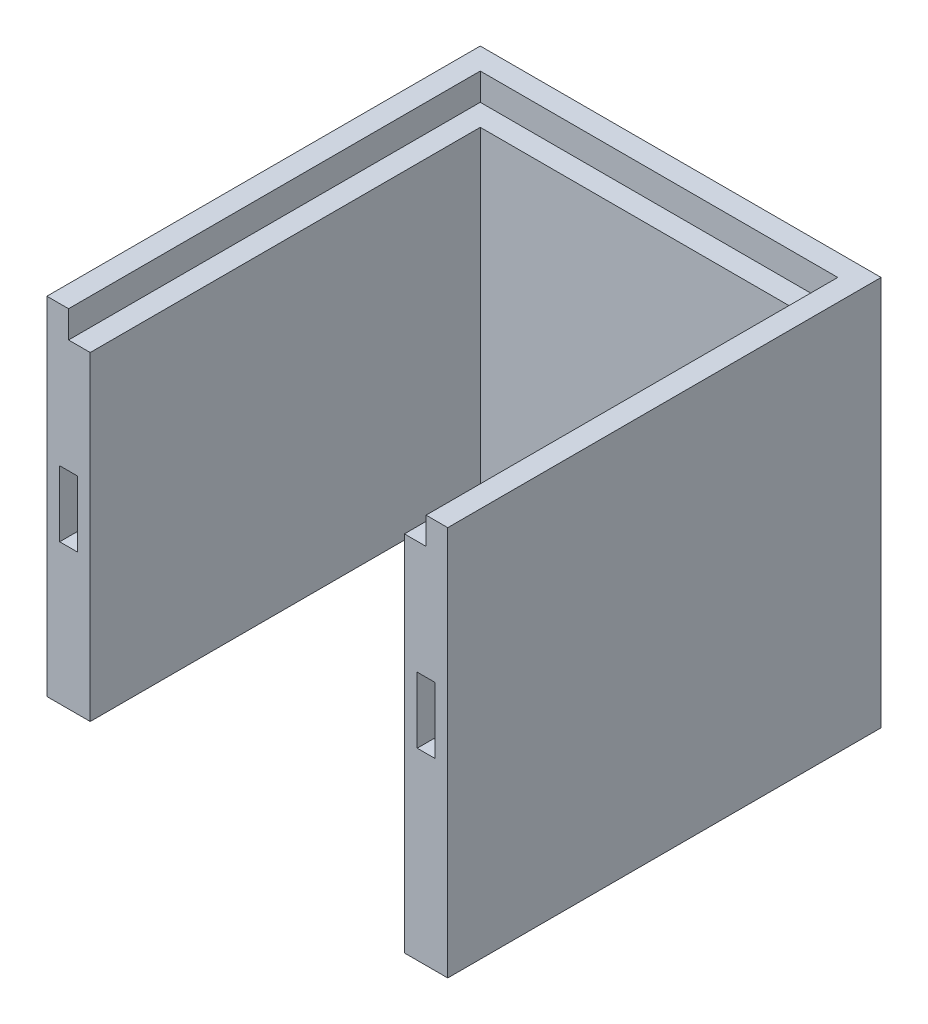
ISO-10303-21;
HEADER;
FILE_DESCRIPTION(('STEP AP214'),'2;1');
FILE_NAME('part.step','',(''),(''),'','','');
FILE_SCHEMA(('AUTOMOTIVE_DESIGN { 1 0 10303 214 1 1 1 1 }'));
ENDSEC;
DATA;
#1=APPLICATION_CONTEXT('core data for automotive mechanical design processes');
#2=APPLICATION_PROTOCOL_DEFINITION('international standard','automotive_design',2000,#1);
#3=PRODUCT_CONTEXT('',#1,'mechanical');
#4=PRODUCT('Part','Part','',(#3));
#5=PRODUCT_RELATED_PRODUCT_CATEGORY('part','',(#4));
#6=PRODUCT_DEFINITION_FORMATION('','',#4);
#7=PRODUCT_DEFINITION_CONTEXT('part definition',#1,'design');
#8=PRODUCT_DEFINITION('design','',#6,#7);
#9=PRODUCT_DEFINITION_SHAPE('','',#8);
#10=(LENGTH_UNIT() NAMED_UNIT(*) SI_UNIT(.MILLI.,.METRE.));
#11=(NAMED_UNIT(*) PLANE_ANGLE_UNIT() SI_UNIT($,.RADIAN.));
#12=(NAMED_UNIT(*) SI_UNIT($,.STERADIAN.) SOLID_ANGLE_UNIT());
#13=UNCERTAINTY_MEASURE_WITH_UNIT(LENGTH_MEASURE(1.E-05),#10,'distance_accuracy_value','');
#14=(GEOMETRIC_REPRESENTATION_CONTEXT(3) GLOBAL_UNCERTAINTY_ASSIGNED_CONTEXT((#13)) GLOBAL_UNIT_ASSIGNED_CONTEXT((#10,
#11,#12)) REPRESENTATION_CONTEXT('',''));
#15=CARTESIAN_POINT('',(0.,0.,0.));
#16=DIRECTION('',(0.,0.,1.));
#17=DIRECTION('',(1.,0.,0.));
#18=AXIS2_PLACEMENT_3D('',#15,#16,#17);
#19=CARTESIAN_POINT('',(0.,0.,200.));
#20=DIRECTION('',(0.,0.,-1.));
#21=DIRECTION('',(-1.,0.,0.));
#22=AXIS2_PLACEMENT_3D('',#19,#20,#21);
#23=PLANE('',#22);
#24=DIRECTION('',(-1.,0.,0.));
#25=VECTOR('',#24,1.);
#26=CARTESIAN_POINT('',(185.,160.,200.));
#27=LINE('',#26,#25);
#28=CARTESIAN_POINT('',(185.,160.,200.));
#29=VERTEX_POINT('',#28);
#30=CARTESIAN_POINT('',(175.,160.,200.));
#31=VERTEX_POINT('',#30);
#32=EDGE_CURVE('E439',#29,#31,#27,.T.);
#33=ORIENTED_EDGE('',*,*,#32,.T.);
#34=DIRECTION('',(0.,1.,0.));
#35=VECTOR('',#34,1.);
#36=CARTESIAN_POINT('',(175.,147.5,200.));
#37=LINE('',#36,#35);
#38=CARTESIAN_POINT('',(175.,147.5,200.));
#39=VERTEX_POINT('',#38);
#40=EDGE_CURVE('E271',#39,#31,#37,.T.);
#41=ORIENTED_EDGE('',*,*,#40,.F.);
#42=DIRECTION('',(1.,0.,0.));
#43=VECTOR('',#42,1.);
#44=CARTESIAN_POINT('',(10.,147.5,200.));
#45=LINE('',#44,#43);
#46=CARTESIAN_POINT('',(165.,147.5,200.));
#47=VERTEX_POINT('',#46);
#48=EDGE_CURVE('E280',#47,#39,#45,.T.);
#49=ORIENTED_EDGE('',*,*,#48,.F.);
#50=DIRECTION('',(0.,-1.,0.));
#51=VECTOR('',#50,1.);
#52=CARTESIAN_POINT('',(165.,160.,200.));
#53=LINE('',#52,#51);
#54=CARTESIAN_POINT('',(165.,-20.,200.));
#55=VERTEX_POINT('',#54);
#56=EDGE_CURVE('E443',#47,#55,#53,.T.);
#57=ORIENTED_EDGE('',*,*,#56,.T.);
#58=DIRECTION('',(-1.,0.,0.));
#59=VECTOR('',#58,1.);
#60=CARTESIAN_POINT('',(185.,-20.,200.));
#61=LINE('',#60,#59);
#62=CARTESIAN_POINT('',(185.,-20.,200.));
#63=VERTEX_POINT('',#62);
#64=EDGE_CURVE('E395',#63,#55,#61,.T.);
#65=ORIENTED_EDGE('',*,*,#64,.F.);
#66=DIRECTION('',(0.,1.,0.));
#67=VECTOR('',#66,1.);
#68=CARTESIAN_POINT('',(185.,160.,200.));
#69=LINE('',#68,#67);
#70=EDGE_CURVE('E435',#63,#29,#69,.T.);
#71=ORIENTED_EDGE('',*,*,#70,.T.);
#72=EDGE_LOOP('',(#33,#41,#49,#57,#65,#71));
#73=FACE_BOUND('',#72,.T.);
#74=DIRECTION('',(0.,1.,0.));
#75=VECTOR('',#74,1.);
#76=CARTESIAN_POINT('',(170.9,64.8,200.));
#77=LINE('',#76,#75);
#78=CARTESIAN_POINT('',(170.9,64.8,200.));
#79=VERTEX_POINT('',#78);
#80=CARTESIAN_POINT('',(170.9,95.2,200.));
#81=VERTEX_POINT('',#80);
#82=EDGE_CURVE('E319',#79,#81,#77,.T.);
#83=ORIENTED_EDGE('',*,*,#82,.T.);
#84=DIRECTION('',(1.,0.,0.));
#85=VECTOR('',#84,1.);
#86=CARTESIAN_POINT('',(179.1,95.2,200.));
#87=LINE('',#86,#85);
#88=CARTESIAN_POINT('',(179.1,95.2,200.));
#89=VERTEX_POINT('',#88);
#90=EDGE_CURVE('E325',#81,#89,#87,.T.);
#91=ORIENTED_EDGE('',*,*,#90,.T.);
#92=DIRECTION('',(0.,-1.,0.));
#93=VECTOR('',#92,1.);
#94=CARTESIAN_POINT('',(179.1,64.8,200.));
#95=LINE('',#94,#93);
#96=CARTESIAN_POINT('',(179.1,64.8,200.));
#97=VERTEX_POINT('',#96);
#98=EDGE_CURVE('E337',#89,#97,#95,.T.);
#99=ORIENTED_EDGE('',*,*,#98,.T.);
#100=DIRECTION('',(-1.,0.,0.));
#101=VECTOR('',#100,1.);
#102=CARTESIAN_POINT('',(179.1,64.8,200.));
#103=LINE('',#102,#101);
#104=EDGE_CURVE('E333',#97,#79,#103,.T.);
#105=ORIENTED_EDGE('',*,*,#104,.T.);
#106=EDGE_LOOP('',(#83,#91,#99,#105));
#107=FACE_BOUND('',#106,.T.);
#108=ADVANCED_FACE('F38',(#73,#107),#23,.F.);
#109=CARTESIAN_POINT('',(0.,0.,20.));
#110=DIRECTION('',(0.,1.,0.));
#111=DIRECTION('',(0.,0.,1.));
#112=AXIS2_PLACEMENT_3D('',#109,#110,#111);
#113=PLANE('',#112);
#114=DIRECTION('',(1.,0.,0.));
#115=VECTOR('',#114,1.);
#116=CARTESIAN_POINT('',(0.,0.,0.));
#117=LINE('',#116,#115);
#118=CARTESIAN_POINT('',(122.5,0.,0.));
#119=VERTEX_POINT('',#118);
#120=CARTESIAN_POINT('',(160.,0.,0.));
#121=VERTEX_POINT('',#120);
#122=EDGE_CURVE('E478',#119,#121,#117,.T.);
#123=ORIENTED_EDGE('',*,*,#122,.T.);
#124=DIRECTION('',(0.,0.,-1.));
#125=VECTOR('',#124,1.);
#126=CARTESIAN_POINT('',(160.,0.,20.));
#127=LINE('',#126,#125);
#128=CARTESIAN_POINT('',(160.,0.,20.));
#129=VERTEX_POINT('',#128);
#130=EDGE_CURVE('E508',#121,#129,#127,.F.);
#131=ORIENTED_EDGE('',*,*,#130,.T.);
#132=DIRECTION('',(1.,0.,0.));
#133=VECTOR('',#132,1.);
#134=CARTESIAN_POINT('',(0.,0.,20.));
#135=LINE('',#134,#133);
#136=CARTESIAN_POINT('',(122.5,0.,20.));
#137=VERTEX_POINT('',#136);
#138=EDGE_CURVE('E474',#137,#129,#135,.T.);
#139=ORIENTED_EDGE('',*,*,#138,.F.);
#140=DIRECTION('',(0.,0.,-1.));
#141=VECTOR('',#140,1.);
#142=CARTESIAN_POINT('',(122.5,0.,20.));
#143=LINE('',#142,#141);
#144=EDGE_CURVE('E504',#137,#119,#143,.T.);
#145=ORIENTED_EDGE('',*,*,#144,.T.);
#146=EDGE_LOOP('',(#123,#131,#139,#145));
#147=FACE_BOUND('',#146,.T.);
#148=ADVANCED_FACE('F650',(#147),#113,.F.);
#149=CARTESIAN_POINT('',(0.,0.,0.));
#150=VERTEX_POINT('',#149);
#151=CARTESIAN_POINT('',(62.5,0.,0.));
#152=VERTEX_POINT('',#151);
#153=EDGE_CURVE('E479',#150,#152,#117,.T.);
#154=ORIENTED_EDGE('',*,*,#153,.T.);
#155=DIRECTION('',(0.,0.,-1.));
#156=VECTOR('',#155,1.);
#157=CARTESIAN_POINT('',(62.5,0.,20.));
#158=LINE('',#157,#156);
#159=CARTESIAN_POINT('',(62.5,0.,20.));
#160=VERTEX_POINT('',#159);
#161=EDGE_CURVE('E537',#152,#160,#158,.F.);
#162=ORIENTED_EDGE('',*,*,#161,.T.);
#163=CARTESIAN_POINT('',(20.,0.,20.));
#164=VERTEX_POINT('',#163);
#165=EDGE_CURVE('E469',#164,#160,#135,.T.);
#166=ORIENTED_EDGE('',*,*,#165,.F.);
#167=DIRECTION('',(0.,0.,-1.));
#168=VECTOR('',#167,1.);
#169=CARTESIAN_POINT('',(20.,0.,200.));
#170=LINE('',#169,#168);
#171=CARTESIAN_POINT('',(20.,0.,200.));
#172=VERTEX_POINT('',#171);
#173=EDGE_CURVE('E461',#172,#164,#170,.T.);
#174=ORIENTED_EDGE('',*,*,#173,.F.);
#175=DIRECTION('',(1.,0.,0.));
#176=VECTOR('',#175,1.);
#177=CARTESIAN_POINT('',(0.,0.,200.));
#178=LINE('',#177,#176);
#179=CARTESIAN_POINT('',(0.,0.,200.));
#180=VERTEX_POINT('',#179);
#181=EDGE_CURVE('E453',#180,#172,#178,.T.);
#182=ORIENTED_EDGE('',*,*,#181,.F.);
#183=DIRECTION('',(0.,0.,-1.));
#184=VECTOR('',#183,1.);
#185=CARTESIAN_POINT('',(0.,0.,20.));
#186=LINE('',#185,#184);
#187=EDGE_CURVE('E496',#180,#150,#186,.T.);
#188=ORIENTED_EDGE('',*,*,#187,.T.);
#189=EDGE_LOOP('',(#154,#162,#166,#174,#182,#188));
#190=FACE_BOUND('',#189,.T.);
#191=ADVANCED_FACE('F656',(#190),#113,.F.);
#192=CARTESIAN_POINT('',(0.,0.,20.));
#193=DIRECTION('',(0.,0.,-1.));
#194=DIRECTION('',(-1.,0.,0.));
#195=AXIS2_PLACEMENT_3D('',#192,#193,#194);
#196=PLANE('',#195);
#197=DIRECTION('',(0.,-1.,0.));
#198=VECTOR('',#197,1.);
#199=CARTESIAN_POINT('',(165.,160.,20.));
#200=LINE('',#199,#198);
#201=CARTESIAN_POINT('',(165.,147.5,20.));
#202=VERTEX_POINT('',#201);
#203=CARTESIAN_POINT('',(165.,-5.,20.));
#204=VERTEX_POINT('',#203);
#205=EDGE_CURVE('E434',#202,#204,#200,.T.);
#206=ORIENTED_EDGE('',*,*,#205,.F.);
#207=DIRECTION('',(-1.,0.,0.));
#208=VECTOR('',#207,1.);
#209=CARTESIAN_POINT('',(0.,147.5,20.));
#210=LINE('',#209,#208);
#211=CARTESIAN_POINT('',(20.,147.5,20.));
#212=VERTEX_POINT('',#211);
#213=EDGE_CURVE('E54',#202,#212,#210,.T.);
#214=ORIENTED_EDGE('',*,*,#213,.T.);
#215=DIRECTION('',(0.,1.,0.));
#216=VECTOR('',#215,1.);
#217=CARTESIAN_POINT('',(20.,160.,20.));
#218=LINE('',#217,#216);
#219=EDGE_CURVE('E446',#164,#212,#218,.T.);
#220=ORIENTED_EDGE('',*,*,#219,.F.);
#221=ORIENTED_EDGE('',*,*,#165,.T.);
#222=CARTESIAN_POINT('',(62.5,5.,20.));
#223=DIRECTION('',(0.,0.,-1.));
#224=DIRECTION('',(-1.,0.,0.));
#225=AXIS2_PLACEMENT_3D('',#222,#223,#224);
#226=CIRCLE('',#225,5.);
#227=CARTESIAN_POINT('',(67.5,5.,20.));
#228=VERTEX_POINT('',#227);
#229=EDGE_CURVE('E524',#160,#228,#226,.F.);
#230=ORIENTED_EDGE('',*,*,#229,.T.);
#231=DIRECTION('',(0.,1.,0.));
#232=VECTOR('',#231,1.);
#233=CARTESIAN_POINT('',(67.5,0.,20.));
#234=LINE('',#233,#232);
#235=CARTESIAN_POINT('',(67.5,45.,20.));
#236=VERTEX_POINT('',#235);
#237=EDGE_CURVE('E430',#228,#236,#234,.T.);
#238=ORIENTED_EDGE('',*,*,#237,.T.);
#239=CARTESIAN_POINT('',(72.5,45.,20.));
#240=DIRECTION('',(0.,0.,-1.));
#241=DIRECTION('',(-1.,0.,0.));
#242=AXIS2_PLACEMENT_3D('',#239,#240,#241);
#243=CIRCLE('',#242,5.);
#244=CARTESIAN_POINT('',(72.5,50.,20.));
#245=VERTEX_POINT('',#244);
#246=EDGE_CURVE('E563',#236,#245,#243,.T.);
#247=ORIENTED_EDGE('',*,*,#246,.T.);
#248=DIRECTION('',(1.,0.,0.));
#249=VECTOR('',#248,1.);
#250=CARTESIAN_POINT('',(0.,50.,20.));
#251=LINE('',#250,#249);
#252=CARTESIAN_POINT('',(112.5,50.,20.));
#253=VERTEX_POINT('',#252);
#254=EDGE_CURVE('E422',#245,#253,#251,.T.);
#255=ORIENTED_EDGE('',*,*,#254,.T.);
#256=CARTESIAN_POINT('',(112.5,45.,20.));
#257=DIRECTION('',(0.,0.,-1.));
#258=DIRECTION('',(-1.,0.,0.));
#259=AXIS2_PLACEMENT_3D('',#256,#257,#258);
#260=CIRCLE('',#259,5.);
#261=CARTESIAN_POINT('',(117.5,45.,20.));
#262=VERTEX_POINT('',#261);
#263=EDGE_CURVE('E557',#253,#262,#260,.T.);
#264=ORIENTED_EDGE('',*,*,#263,.T.);
#265=DIRECTION('',(0.,-1.,0.));
#266=VECTOR('',#265,1.);
#267=CARTESIAN_POINT('',(117.5,0.,20.));
#268=LINE('',#267,#266);
#269=CARTESIAN_POINT('',(117.5,5.,20.));
#270=VERTEX_POINT('',#269);
#271=EDGE_CURVE('E426',#262,#270,#268,.T.);
#272=ORIENTED_EDGE('',*,*,#271,.T.);
#273=CARTESIAN_POINT('',(122.5,5.,20.));
#274=DIRECTION('',(0.,0.,-1.));
#275=DIRECTION('',(-1.,0.,0.));
#276=AXIS2_PLACEMENT_3D('',#273,#274,#275);
#277=CIRCLE('',#276,5.);
#278=EDGE_CURVE('E527',#270,#137,#277,.F.);
#279=ORIENTED_EDGE('',*,*,#278,.T.);
#280=ORIENTED_EDGE('',*,*,#138,.T.);
#281=CARTESIAN_POINT('',(160.,-5.,20.));
#282=DIRECTION('',(0.,0.,-1.));
#283=DIRECTION('',(-1.,0.,0.));
#284=AXIS2_PLACEMENT_3D('',#281,#282,#283);
#285=CIRCLE('',#284,5.);
#286=EDGE_CURVE('E550',#129,#204,#285,.T.);
#287=ORIENTED_EDGE('',*,*,#286,.T.);
#288=EDGE_LOOP('',(#206,#214,#220,#221,#230,#238,#247,#255,#264,#272,#279,#280,#287));
#289=FACE_BOUND('',#288,.T.);
#290=ADVANCED_FACE('F674',(#289),#196,.F.);
#291=CARTESIAN_POINT('',(0.,0.,20.));
#292=DIRECTION('',(1.,0.,0.));
#293=DIRECTION('',(0.,0.,-1.));
#294=AXIS2_PLACEMENT_3D('',#291,#292,#293);
#295=PLANE('',#294);
#296=DIRECTION('',(0.,-1.,0.));
#297=VECTOR('',#296,1.);
#298=CARTESIAN_POINT('',(0.,0.,0.));
#299=LINE('',#298,#297);
#300=CARTESIAN_POINT('',(0.,160.,0.));
#301=VERTEX_POINT('',#300);
#302=EDGE_CURVE('E468',#301,#150,#299,.T.);
#303=ORIENTED_EDGE('',*,*,#302,.T.);
#304=ORIENTED_EDGE('',*,*,#187,.F.);
#305=DIRECTION('',(0.,-1.,0.));
#306=VECTOR('',#305,1.);
#307=CARTESIAN_POINT('',(0.,160.,200.));
#308=LINE('',#307,#306);
#309=CARTESIAN_POINT('',(0.,160.,200.));
#310=VERTEX_POINT('',#309);
#311=EDGE_CURVE('E449',#310,#180,#308,.T.);
#312=ORIENTED_EDGE('',*,*,#311,.F.);
#313=DIRECTION('',(0.,0.,-1.));
#314=VECTOR('',#313,1.);
#315=CARTESIAN_POINT('',(0.,160.,20.));
#316=LINE('',#315,#314);
#317=EDGE_CURVE('E473',#310,#301,#316,.T.);
#318=ORIENTED_EDGE('',*,*,#317,.T.);
#319=EDGE_LOOP('',(#303,#304,#312,#318));
#320=FACE_BOUND('',#319,.T.);
#321=ADVANCED_FACE('F677',(#320),#295,.F.);
#322=CARTESIAN_POINT('',(185.,0.,20.));
#323=DIRECTION('',(-1.,0.,0.));
#324=DIRECTION('',(0.,0.,1.));
#325=AXIS2_PLACEMENT_3D('',#322,#323,#324);
#326=PLANE('',#325);
#327=DIRECTION('',(0.,1.,0.));
#328=VECTOR('',#327,1.);
#329=CARTESIAN_POINT('',(185.,0.,0.));
#330=LINE('',#329,#328);
#331=CARTESIAN_POINT('',(185.,-20.,0.));
#332=VERTEX_POINT('',#331);
#333=CARTESIAN_POINT('',(185.,160.,0.));
#334=VERTEX_POINT('',#333);
#335=EDGE_CURVE('E483',#332,#334,#330,.T.);
#336=ORIENTED_EDGE('',*,*,#335,.T.);
#337=DIRECTION('',(0.,0.,-1.));
#338=VECTOR('',#337,1.);
#339=CARTESIAN_POINT('',(185.,160.,20.));
#340=LINE('',#339,#338);
#341=EDGE_CURVE('E492',#29,#334,#340,.T.);
#342=ORIENTED_EDGE('',*,*,#341,.F.);
#343=ORIENTED_EDGE('',*,*,#70,.F.);
#344=DIRECTION('',(0.,0.,1.));
#345=VECTOR('',#344,1.);
#346=CARTESIAN_POINT('',(185.,-20.,0.));
#347=LINE('',#346,#345);
#348=EDGE_CURVE('E383',#332,#63,#347,.T.);
#349=ORIENTED_EDGE('',*,*,#348,.F.);
#350=EDGE_LOOP('',(#336,#342,#343,#349));
#351=FACE_BOUND('',#350,.T.);
#352=ADVANCED_FACE('F685',(#351),#326,.F.);
#353=CARTESIAN_POINT('',(0.,160.,20.));
#354=DIRECTION('',(0.,-1.,0.));
#355=DIRECTION('',(0.,0.,-1.));
#356=AXIS2_PLACEMENT_3D('',#353,#354,#355);
#357=PLANE('',#356);
#358=DIRECTION('',(-1.,0.,0.));
#359=VECTOR('',#358,1.);
#360=CARTESIAN_POINT('',(0.,160.,200.));
#361=LINE('',#360,#359);
#362=CARTESIAN_POINT('',(10.,160.,200.));
#363=VERTEX_POINT('',#362);
#364=EDGE_CURVE('E458',#363,#310,#361,.T.);
#365=ORIENTED_EDGE('',*,*,#364,.F.);
#366=DIRECTION('',(0.,0.,1.));
#367=VECTOR('',#366,1.);
#368=CARTESIAN_POINT('',(10.,160.,200.));
#369=LINE('',#368,#367);
#370=CARTESIAN_POINT('',(10.,160.,10.));
#371=VERTEX_POINT('',#370);
#372=EDGE_CURVE('E266',#371,#363,#369,.T.);
#373=ORIENTED_EDGE('',*,*,#372,.F.);
#374=DIRECTION('',(-1.,0.,0.));
#375=VECTOR('',#374,1.);
#376=CARTESIAN_POINT('',(10.,160.,10.));
#377=LINE('',#376,#375);
#378=CARTESIAN_POINT('',(175.,160.,10.));
#379=VERTEX_POINT('',#378);
#380=EDGE_CURVE('E281',#379,#371,#377,.T.);
#381=ORIENTED_EDGE('',*,*,#380,.F.);
#382=DIRECTION('',(0.,0.,-1.));
#383=VECTOR('',#382,1.);
#384=CARTESIAN_POINT('',(175.,160.,200.));
#385=LINE('',#384,#383);
#386=EDGE_CURVE('E299',#31,#379,#385,.T.);
#387=ORIENTED_EDGE('',*,*,#386,.F.);
#388=ORIENTED_EDGE('',*,*,#32,.F.);
#389=ORIENTED_EDGE('',*,*,#341,.T.);
#390=DIRECTION('',(-1.,0.,0.));
#391=VECTOR('',#390,1.);
#392=CARTESIAN_POINT('',(0.,160.,0.));
#393=LINE('',#392,#391);
#394=EDGE_CURVE('E486',#334,#301,#393,.T.);
#395=ORIENTED_EDGE('',*,*,#394,.T.);
#396=ORIENTED_EDGE('',*,*,#317,.F.);
#397=EDGE_LOOP('',(#365,#373,#381,#387,#388,#389,#395,#396));
#398=FACE_BOUND('',#397,.T.);
#399=ADVANCED_FACE('F681',(#398),#357,.F.);
#400=CARTESIAN_POINT('',(0.,0.,0.));
#401=DIRECTION('',(0.,0.,-1.));
#402=DIRECTION('',(-1.,0.,0.));
#403=AXIS2_PLACEMENT_3D('',#400,#401,#402);
#404=PLANE('',#403);
#405=ORIENTED_EDGE('',*,*,#122,.F.);
#406=CARTESIAN_POINT('',(122.5,5.,0.));
#407=DIRECTION('',(0.,0.,-1.));
#408=DIRECTION('',(-1.,0.,0.));
#409=AXIS2_PLACEMENT_3D('',#406,#407,#408);
#410=CIRCLE('',#409,5.);
#411=CARTESIAN_POINT('',(117.5,5.,0.));
#412=VERTEX_POINT('',#411);
#413=EDGE_CURVE('E514',#119,#412,#410,.T.);
#414=ORIENTED_EDGE('',*,*,#413,.T.);
#415=DIRECTION('',(0.,-1.,0.));
#416=VECTOR('',#415,1.);
#417=CARTESIAN_POINT('',(117.5,50.,0.));
#418=LINE('',#417,#416);
#419=CARTESIAN_POINT('',(117.5,45.,0.));
#420=VERTEX_POINT('',#419);
#421=EDGE_CURVE('E418',#420,#412,#418,.T.);
#422=ORIENTED_EDGE('',*,*,#421,.F.);
#423=CARTESIAN_POINT('',(112.5,45.,0.));
#424=DIRECTION('',(0.,0.,-1.));
#425=DIRECTION('',(-1.,0.,0.));
#426=AXIS2_PLACEMENT_3D('',#423,#424,#425);
#427=CIRCLE('',#426,5.);
#428=CARTESIAN_POINT('',(112.5,50.,0.));
#429=VERTEX_POINT('',#428);
#430=EDGE_CURVE('E554',#420,#429,#427,.F.);
#431=ORIENTED_EDGE('',*,*,#430,.T.);
#432=DIRECTION('',(1.,0.,0.));
#433=VECTOR('',#432,1.);
#434=CARTESIAN_POINT('',(117.5,50.,0.));
#435=LINE('',#434,#433);
#436=CARTESIAN_POINT('',(72.5,50.,0.));
#437=VERTEX_POINT('',#436);
#438=EDGE_CURVE('E414',#437,#429,#435,.T.);
#439=ORIENTED_EDGE('',*,*,#438,.F.);
#440=CARTESIAN_POINT('',(72.5,45.,0.));
#441=DIRECTION('',(0.,0.,-1.));
#442=DIRECTION('',(-1.,0.,0.));
#443=AXIS2_PLACEMENT_3D('',#440,#441,#442);
#444=CIRCLE('',#443,5.);
#445=CARTESIAN_POINT('',(67.5,45.,0.));
#446=VERTEX_POINT('',#445);
#447=EDGE_CURVE('E560',#437,#446,#444,.F.);
#448=ORIENTED_EDGE('',*,*,#447,.T.);
#449=DIRECTION('',(0.,1.,0.));
#450=VECTOR('',#449,1.);
#451=CARTESIAN_POINT('',(67.5,50.,0.));
#452=LINE('',#451,#450);
#453=CARTESIAN_POINT('',(67.5,5.,0.));
#454=VERTEX_POINT('',#453);
#455=EDGE_CURVE('E410',#454,#446,#452,.T.);
#456=ORIENTED_EDGE('',*,*,#455,.F.);
#457=CARTESIAN_POINT('',(62.5,5.,0.));
#458=DIRECTION('',(0.,0.,-1.));
#459=DIRECTION('',(-1.,0.,0.));
#460=AXIS2_PLACEMENT_3D('',#457,#458,#459);
#461=CIRCLE('',#460,5.);
#462=EDGE_CURVE('E511',#454,#152,#461,.T.);
#463=ORIENTED_EDGE('',*,*,#462,.T.);
#464=ORIENTED_EDGE('',*,*,#153,.F.);
#465=ORIENTED_EDGE('',*,*,#302,.F.);
#466=ORIENTED_EDGE('',*,*,#394,.F.);
#467=ORIENTED_EDGE('',*,*,#335,.F.);
#468=DIRECTION('',(1.,0.,0.));
#469=VECTOR('',#468,1.);
#470=CARTESIAN_POINT('',(185.,-20.,0.));
#471=LINE('',#470,#469);
#472=CARTESIAN_POINT('',(165.,-20.,0.));
#473=VERTEX_POINT('',#472);
#474=EDGE_CURVE('E402',#473,#332,#471,.T.);
#475=ORIENTED_EDGE('',*,*,#474,.F.);
#476=DIRECTION('',(0.,1.,0.));
#477=VECTOR('',#476,1.);
#478=CARTESIAN_POINT('',(165.,-20.,0.));
#479=LINE('',#478,#477);
#480=CARTESIAN_POINT('',(165.,-5.,0.));
#481=VERTEX_POINT('',#480);
#482=EDGE_CURVE('E406',#473,#481,#479,.T.);
#483=ORIENTED_EDGE('',*,*,#482,.T.);
#484=CARTESIAN_POINT('',(160.,-5.,0.));
#485=DIRECTION('',(0.,0.,-1.));
#486=DIRECTION('',(-1.,0.,0.));
#487=AXIS2_PLACEMENT_3D('',#484,#485,#486);
#488=CIRCLE('',#487,5.);
#489=EDGE_CURVE('E547',#481,#121,#488,.F.);
#490=ORIENTED_EDGE('',*,*,#489,.T.);
#491=EDGE_LOOP('',(#405,#414,#422,#431,#439,#448,#456,#463,#464,#465,#466,#467,#475,#483,#490));
#492=FACE_BOUND('',#491,.T.);
#493=ADVANCED_FACE('F672',(#492),#404,.T.);
#494=CARTESIAN_POINT('',(20.,160.,200.));
#495=DIRECTION('',(-1.,0.,0.));
#496=DIRECTION('',(0.,-1.,0.));
#497=AXIS2_PLACEMENT_3D('',#494,#495,#496);
#498=PLANE('',#497);
#499=ORIENTED_EDGE('',*,*,#219,.T.);
#500=DIRECTION('',(0.,0.,1.));
#501=VECTOR('',#500,1.);
#502=CARTESIAN_POINT('',(20.,147.5,200.));
#503=LINE('',#502,#501);
#504=CARTESIAN_POINT('',(20.,147.5,200.));
#505=VERTEX_POINT('',#504);
#506=EDGE_CURVE('E316',#212,#505,#503,.T.);
#507=ORIENTED_EDGE('',*,*,#506,.T.);
#508=DIRECTION('',(0.,1.,0.));
#509=VECTOR('',#508,1.);
#510=CARTESIAN_POINT('',(20.,160.,200.));
#511=LINE('',#510,#509);
#512=EDGE_CURVE('E287',#172,#505,#511,.T.);
#513=ORIENTED_EDGE('',*,*,#512,.F.);
#514=ORIENTED_EDGE('',*,*,#173,.T.);
#515=EDGE_LOOP('',(#499,#507,#513,#514));
#516=FACE_BOUND('',#515,.T.);
#517=ADVANCED_FACE('F669',(#516),#498,.F.);
#518=CARTESIAN_POINT('',(0.,0.,200.));
#519=DIRECTION('',(0.,0.,1.));
#520=DIRECTION('',(1.,0.,0.));
#521=AXIS2_PLACEMENT_3D('',#518,#519,#520);
#522=PLANE('',#521);
#523=DIRECTION('',(0.,1.,0.));
#524=VECTOR('',#523,1.);
#525=CARTESIAN_POINT('',(10.,147.5,200.));
#526=LINE('',#525,#524);
#527=CARTESIAN_POINT('',(10.,147.5,200.));
#528=VERTEX_POINT('',#527);
#529=EDGE_CURVE('E260',#528,#363,#526,.T.);
#530=ORIENTED_EDGE('',*,*,#529,.T.);
#531=ORIENTED_EDGE('',*,*,#364,.T.);
#532=ORIENTED_EDGE('',*,*,#311,.T.);
#533=ORIENTED_EDGE('',*,*,#181,.T.);
#534=ORIENTED_EDGE('',*,*,#512,.T.);
#535=EDGE_CURVE('E275',#528,#505,#45,.T.);
#536=ORIENTED_EDGE('',*,*,#535,.F.);
#537=EDGE_LOOP('',(#530,#531,#532,#533,#534,#536));
#538=FACE_BOUND('',#537,.T.);
#539=DIRECTION('',(0.,1.,0.));
#540=VECTOR('',#539,1.);
#541=CARTESIAN_POINT('',(14.1,64.8,200.));
#542=LINE('',#541,#540);
#543=CARTESIAN_POINT('',(14.1,64.8,200.));
#544=VERTEX_POINT('',#543);
#545=CARTESIAN_POINT('',(14.1,95.2,200.));
#546=VERTEX_POINT('',#545);
#547=EDGE_CURVE('E347',#544,#546,#542,.T.);
#548=ORIENTED_EDGE('',*,*,#547,.F.);
#549=DIRECTION('',(1.,0.,0.));
#550=VECTOR('',#549,1.);
#551=CARTESIAN_POINT('',(5.9,64.8,200.));
#552=LINE('',#551,#550);
#553=CARTESIAN_POINT('',(5.9,64.8,200.));
#554=VERTEX_POINT('',#553);
#555=EDGE_CURVE('E361',#554,#544,#552,.T.);
#556=ORIENTED_EDGE('',*,*,#555,.F.);
#557=DIRECTION('',(0.,-1.,0.));
#558=VECTOR('',#557,1.);
#559=CARTESIAN_POINT('',(5.9,64.8,200.));
#560=LINE('',#559,#558);
#561=CARTESIAN_POINT('',(5.9,95.2,200.));
#562=VERTEX_POINT('',#561);
#563=EDGE_CURVE('E373',#562,#554,#560,.T.);
#564=ORIENTED_EDGE('',*,*,#563,.F.);
#565=DIRECTION('',(-1.,0.,0.));
#566=VECTOR('',#565,1.);
#567=CARTESIAN_POINT('',(5.9,95.2,200.));
#568=LINE('',#567,#566);
#569=EDGE_CURVE('E369',#546,#562,#568,.T.);
#570=ORIENTED_EDGE('',*,*,#569,.F.);
#571=EDGE_LOOP('',(#548,#556,#564,#570));
#572=FACE_BOUND('',#571,.T.);
#573=ADVANCED_FACE('F284',(#538,#572),#522,.T.);
#574=CARTESIAN_POINT('',(165.,160.,200.));
#575=DIRECTION('',(1.,0.,0.));
#576=DIRECTION('',(0.,0.,-1.));
#577=AXIS2_PLACEMENT_3D('',#574,#575,#576);
#578=PLANE('',#577);
#579=ORIENTED_EDGE('',*,*,#56,.F.);
#580=DIRECTION('',(0.,0.,-1.));
#581=VECTOR('',#580,1.);
#582=CARTESIAN_POINT('',(165.,147.5,200.));
#583=LINE('',#582,#581);
#584=EDGE_CURVE('E11',#47,#202,#583,.T.);
#585=ORIENTED_EDGE('',*,*,#584,.T.);
#586=ORIENTED_EDGE('',*,*,#205,.T.);
#587=DIRECTION('',(0.,0.,-1.));
#588=VECTOR('',#587,1.);
#589=CARTESIAN_POINT('',(165.,-5.,0.));
#590=LINE('',#589,#588);
#591=EDGE_CURVE('E500',#204,#481,#590,.T.);
#592=ORIENTED_EDGE('',*,*,#591,.T.);
#593=ORIENTED_EDGE('',*,*,#482,.F.);
#594=DIRECTION('',(0.,0.,-1.));
#595=VECTOR('',#594,1.);
#596=CARTESIAN_POINT('',(165.,-20.,0.));
#597=LINE('',#596,#595);
#598=EDGE_CURVE('E399',#55,#473,#597,.T.);
#599=ORIENTED_EDGE('',*,*,#598,.F.);
#600=EDGE_LOOP('',(#579,#585,#586,#592,#593,#599));
#601=FACE_BOUND('',#600,.T.);
#602=ADVANCED_FACE('F663',(#601),#578,.F.);
#603=CARTESIAN_POINT('',(67.5,50.,200.));
#604=DIRECTION('',(-1.,0.,0.));
#605=DIRECTION('',(0.,0.,1.));
#606=AXIS2_PLACEMENT_3D('',#603,#604,#605);
#607=PLANE('',#606);
#608=ORIENTED_EDGE('',*,*,#237,.F.);
#609=DIRECTION('',(0.,0.,-1.));
#610=VECTOR('',#609,1.);
#611=CARTESIAN_POINT('',(67.5,5.,200.));
#612=LINE('',#611,#610);
#613=EDGE_CURVE('E533',#228,#454,#612,.T.);
#614=ORIENTED_EDGE('',*,*,#613,.T.);
#615=ORIENTED_EDGE('',*,*,#455,.T.);
#616=DIRECTION('',(0.,0.,-1.));
#617=VECTOR('',#616,1.);
#618=CARTESIAN_POINT('',(67.5,45.,20.));
#619=LINE('',#618,#617);
#620=EDGE_CURVE('E530',#446,#236,#619,.F.);
#621=ORIENTED_EDGE('',*,*,#620,.T.);
#622=EDGE_LOOP('',(#608,#614,#615,#621));
#623=FACE_BOUND('',#622,.T.);
#624=ADVANCED_FACE('F661',(#623),#607,.F.);
#625=CARTESIAN_POINT('',(117.5,50.,200.));
#626=DIRECTION('',(1.,0.,0.));
#627=DIRECTION('',(0.,1.,0.));
#628=AXIS2_PLACEMENT_3D('',#625,#626,#627);
#629=PLANE('',#628);
#630=ORIENTED_EDGE('',*,*,#421,.T.);
#631=DIRECTION('',(0.,0.,-1.));
#632=VECTOR('',#631,1.);
#633=CARTESIAN_POINT('',(117.5,5.,200.));
#634=LINE('',#633,#632);
#635=EDGE_CURVE('E521',#412,#270,#634,.F.);
#636=ORIENTED_EDGE('',*,*,#635,.T.);
#637=ORIENTED_EDGE('',*,*,#271,.F.);
#638=DIRECTION('',(0.,0.,-1.));
#639=VECTOR('',#638,1.);
#640=CARTESIAN_POINT('',(117.5,45.,0.));
#641=LINE('',#640,#639);
#642=EDGE_CURVE('E517',#262,#420,#641,.T.);
#643=ORIENTED_EDGE('',*,*,#642,.T.);
#644=EDGE_LOOP('',(#630,#636,#637,#643));
#645=FACE_BOUND('',#644,.T.);
#646=ADVANCED_FACE('F773',(#645),#629,.F.);
#647=CARTESIAN_POINT('',(117.5,50.,200.));
#648=DIRECTION('',(0.,1.,0.));
#649=DIRECTION('',(0.,0.,1.));
#650=AXIS2_PLACEMENT_3D('',#647,#648,#649);
#651=PLANE('',#650);
#652=ORIENTED_EDGE('',*,*,#438,.T.);
#653=DIRECTION('',(0.,0.,-1.));
#654=VECTOR('',#653,1.);
#655=CARTESIAN_POINT('',(112.5,50.,20.));
#656=LINE('',#655,#654);
#657=EDGE_CURVE('E544',#429,#253,#656,.F.);
#658=ORIENTED_EDGE('',*,*,#657,.T.);
#659=ORIENTED_EDGE('',*,*,#254,.F.);
#660=DIRECTION('',(0.,0.,-1.));
#661=VECTOR('',#660,1.);
#662=CARTESIAN_POINT('',(72.5,50.,0.));
#663=LINE('',#662,#661);
#664=EDGE_CURVE('E540',#245,#437,#663,.T.);
#665=ORIENTED_EDGE('',*,*,#664,.T.);
#666=EDGE_LOOP('',(#652,#658,#659,#665));
#667=FACE_BOUND('',#666,.T.);
#668=ADVANCED_FACE('F771',(#667),#651,.F.);
#669=CARTESIAN_POINT('',(0.,-20.,0.));
#670=DIRECTION('',(0.,-1.,0.));
#671=DIRECTION('',(0.,0.,-1.));
#672=AXIS2_PLACEMENT_3D('',#669,#670,#671);
#673=PLANE('',#672);
#674=ORIENTED_EDGE('',*,*,#348,.T.);
#675=ORIENTED_EDGE('',*,*,#64,.T.);
#676=ORIENTED_EDGE('',*,*,#598,.T.);
#677=ORIENTED_EDGE('',*,*,#474,.T.);
#678=EDGE_LOOP('',(#674,#675,#676,#677));
#679=FACE_BOUND('',#678,.T.);
#680=ADVANCED_FACE('F697',(#679),#673,.T.);
#681=CARTESIAN_POINT('',(160.,-5.,200.));
#682=DIRECTION('',(0.,0.,1.));
#683=DIRECTION('',(1.,0.,0.));
#684=AXIS2_PLACEMENT_3D('',#681,#682,#683);
#685=CYLINDRICAL_SURFACE('',#684,5.);
#686=ORIENTED_EDGE('',*,*,#286,.F.);
#687=ORIENTED_EDGE('',*,*,#130,.F.);
#688=ORIENTED_EDGE('',*,*,#489,.F.);
#689=ORIENTED_EDGE('',*,*,#591,.F.);
#690=EDGE_LOOP('',(#686,#687,#688,#689));
#691=FACE_BOUND('',#690,.T.);
#692=ADVANCED_FACE('F693',(#691),#685,.F.);
#693=CARTESIAN_POINT('',(122.5,5.,20.));
#694=DIRECTION('',(0.,0.,-1.));
#695=DIRECTION('',(-1.,0.,0.));
#696=AXIS2_PLACEMENT_3D('',#693,#694,#695);
#697=CYLINDRICAL_SURFACE('',#696,5.);
#698=ORIENTED_EDGE('',*,*,#278,.F.);
#699=ORIENTED_EDGE('',*,*,#635,.F.);
#700=ORIENTED_EDGE('',*,*,#413,.F.);
#701=ORIENTED_EDGE('',*,*,#144,.F.);
#702=EDGE_LOOP('',(#698,#699,#700,#701));
#703=FACE_BOUND('',#702,.T.);
#704=ADVANCED_FACE('F696',(#703),#697,.T.);
#705=CARTESIAN_POINT('',(62.5,5.,200.));
#706=DIRECTION('',(0.,0.,-1.));
#707=DIRECTION('',(-1.,0.,0.));
#708=AXIS2_PLACEMENT_3D('',#705,#706,#707);
#709=CYLINDRICAL_SURFACE('',#708,5.);
#710=ORIENTED_EDGE('',*,*,#229,.F.);
#711=ORIENTED_EDGE('',*,*,#161,.F.);
#712=ORIENTED_EDGE('',*,*,#462,.F.);
#713=ORIENTED_EDGE('',*,*,#613,.F.);
#714=EDGE_LOOP('',(#710,#711,#712,#713));
#715=FACE_BOUND('',#714,.T.);
#716=ADVANCED_FACE('F701',(#715),#709,.T.);
#717=CARTESIAN_POINT('',(112.5,45.,200.));
#718=DIRECTION('',(0.,0.,1.));
#719=DIRECTION('',(1.,0.,0.));
#720=AXIS2_PLACEMENT_3D('',#717,#718,#719);
#721=CYLINDRICAL_SURFACE('',#720,5.);
#722=ORIENTED_EDGE('',*,*,#263,.F.);
#723=ORIENTED_EDGE('',*,*,#657,.F.);
#724=ORIENTED_EDGE('',*,*,#430,.F.);
#725=ORIENTED_EDGE('',*,*,#642,.F.);
#726=EDGE_LOOP('',(#722,#723,#724,#725));
#727=FACE_BOUND('',#726,.T.);
#728=ADVANCED_FACE('F705',(#727),#721,.F.);
#729=CARTESIAN_POINT('',(72.5,45.,200.));
#730=DIRECTION('',(0.,0.,1.));
#731=DIRECTION('',(1.,0.,0.));
#732=AXIS2_PLACEMENT_3D('',#729,#730,#731);
#733=CYLINDRICAL_SURFACE('',#732,5.);
#734=ORIENTED_EDGE('',*,*,#246,.F.);
#735=ORIENTED_EDGE('',*,*,#620,.F.);
#736=ORIENTED_EDGE('',*,*,#447,.F.);
#737=ORIENTED_EDGE('',*,*,#664,.F.);
#738=EDGE_LOOP('',(#734,#735,#736,#737));
#739=FACE_BOUND('',#738,.T.);
#740=ADVANCED_FACE('F709',(#739),#733,.F.);
#741=CARTESIAN_POINT('',(14.1,64.8,187.5));
#742=DIRECTION('',(1.,0.,0.));
#743=DIRECTION('',(0.,0.,-1.));
#744=AXIS2_PLACEMENT_3D('',#741,#742,#743);
#745=PLANE('',#744);
#746=DIRECTION('',(0.,1.,0.));
#747=VECTOR('',#746,1.);
#748=CARTESIAN_POINT('',(14.1,64.8,187.5));
#749=LINE('',#748,#747);
#750=CARTESIAN_POINT('',(14.1,69.8,187.5));
#751=VERTEX_POINT('',#750);
#752=CARTESIAN_POINT('',(14.1,90.2,187.5));
#753=VERTEX_POINT('',#752);
#754=EDGE_CURVE('E356',#751,#753,#749,.T.);
#755=ORIENTED_EDGE('',*,*,#754,.F.);
#756=CARTESIAN_POINT('',(14.1,69.8,192.5));
#757=DIRECTION('',(1.,0.,0.));
#758=DIRECTION('',(0.,0.,-1.));
#759=AXIS2_PLACEMENT_3D('',#756,#757,#758);
#760=CIRCLE('',#759,5.);
#761=CARTESIAN_POINT('',(14.1,64.8,192.5));
#762=VERTEX_POINT('',#761);
#763=EDGE_CURVE('E577',#751,#762,#760,.F.);
#764=ORIENTED_EDGE('',*,*,#763,.T.);
#765=DIRECTION('',(0.,0.,1.));
#766=VECTOR('',#765,1.);
#767=CARTESIAN_POINT('',(14.1,64.8,187.5));
#768=LINE('',#767,#766);
#769=EDGE_CURVE('E380',#762,#544,#768,.T.);
#770=ORIENTED_EDGE('',*,*,#769,.T.);
#771=ORIENTED_EDGE('',*,*,#547,.T.);
#772=DIRECTION('',(0.,0.,1.));
#773=VECTOR('',#772,1.);
#774=CARTESIAN_POINT('',(14.1,95.2,187.5));
#775=LINE('',#774,#773);
#776=CARTESIAN_POINT('',(14.1,95.2,192.5));
#777=VERTEX_POINT('',#776);
#778=EDGE_CURVE('E365',#777,#546,#775,.T.);
#779=ORIENTED_EDGE('',*,*,#778,.F.);
#780=CARTESIAN_POINT('',(14.1,90.2,192.5));
#781=DIRECTION('',(1.,0.,0.));
#782=DIRECTION('',(0.,0.,-1.));
#783=AXIS2_PLACEMENT_3D('',#780,#781,#782);
#784=CIRCLE('',#783,5.);
#785=EDGE_CURVE('E574',#777,#753,#784,.F.);
#786=ORIENTED_EDGE('',*,*,#785,.T.);
#787=EDGE_LOOP('',(#755,#764,#770,#771,#779,#786));
#788=FACE_BOUND('',#787,.T.);
#789=ADVANCED_FACE('F713',(#788),#745,.F.);
#790=CARTESIAN_POINT('',(5.9,64.8,187.5));
#791=DIRECTION('',(0.,-1.,0.));
#792=DIRECTION('',(0.,0.,-1.));
#793=AXIS2_PLACEMENT_3D('',#790,#791,#792);
#794=PLANE('',#793);
#795=ORIENTED_EDGE('',*,*,#769,.F.);
#796=DIRECTION('',(1.,0.,0.));
#797=VECTOR('',#796,1.);
#798=CARTESIAN_POINT('',(5.9,64.8,192.5));
#799=LINE('',#798,#797);
#800=CARTESIAN_POINT('',(5.9,64.8,192.5));
#801=VERTEX_POINT('',#800);
#802=EDGE_CURVE('E580',#762,#801,#799,.F.);
#803=ORIENTED_EDGE('',*,*,#802,.T.);
#804=DIRECTION('',(0.,0.,1.));
#805=VECTOR('',#804,1.);
#806=CARTESIAN_POINT('',(5.9,64.8,187.5));
#807=LINE('',#806,#805);
#808=EDGE_CURVE('E384',#801,#554,#807,.T.);
#809=ORIENTED_EDGE('',*,*,#808,.T.);
#810=ORIENTED_EDGE('',*,*,#555,.T.);
#811=EDGE_LOOP('',(#795,#803,#809,#810));
#812=FACE_BOUND('',#811,.T.);
#813=ADVANCED_FACE('F755',(#812),#794,.F.);
#814=CARTESIAN_POINT('',(5.9,64.8,187.5));
#815=DIRECTION('',(-1.,0.,0.));
#816=DIRECTION('',(0.,0.,1.));
#817=AXIS2_PLACEMENT_3D('',#814,#815,#816);
#818=PLANE('',#817);
#819=ORIENTED_EDGE('',*,*,#808,.F.);
#820=CARTESIAN_POINT('',(5.9,69.8,192.5));
#821=DIRECTION('',(-1.,0.,0.));
#822=DIRECTION('',(0.,0.,1.));
#823=AXIS2_PLACEMENT_3D('',#820,#821,#822);
#824=CIRCLE('',#823,5.);
#825=CARTESIAN_POINT('',(5.9,69.8,187.5));
#826=VERTEX_POINT('',#825);
#827=EDGE_CURVE('E586',#801,#826,#824,.F.);
#828=ORIENTED_EDGE('',*,*,#827,.T.);
#829=DIRECTION('',(0.,-1.,0.));
#830=VECTOR('',#829,1.);
#831=CARTESIAN_POINT('',(5.9,64.8,187.5));
#832=LINE('',#831,#830);
#833=CARTESIAN_POINT('',(5.9,90.2,187.5));
#834=VERTEX_POINT('',#833);
#835=EDGE_CURVE('E360',#834,#826,#832,.T.);
#836=ORIENTED_EDGE('',*,*,#835,.F.);
#837=CARTESIAN_POINT('',(5.9,90.2,192.5));
#838=DIRECTION('',(-1.,0.,0.));
#839=DIRECTION('',(0.,0.,1.));
#840=AXIS2_PLACEMENT_3D('',#837,#838,#839);
#841=CIRCLE('',#840,5.);
#842=CARTESIAN_POINT('',(5.9,95.2,192.5));
#843=VERTEX_POINT('',#842);
#844=EDGE_CURVE('E583',#834,#843,#841,.F.);
#845=ORIENTED_EDGE('',*,*,#844,.T.);
#846=DIRECTION('',(0.,0.,1.));
#847=VECTOR('',#846,1.);
#848=CARTESIAN_POINT('',(5.9,95.2,187.5));
#849=LINE('',#848,#847);
#850=EDGE_CURVE('E387',#843,#562,#849,.T.);
#851=ORIENTED_EDGE('',*,*,#850,.T.);
#852=ORIENTED_EDGE('',*,*,#563,.T.);
#853=EDGE_LOOP('',(#819,#828,#836,#845,#851,#852));
#854=FACE_BOUND('',#853,.T.);
#855=ADVANCED_FACE('F758',(#854),#818,.F.);
#856=CARTESIAN_POINT('',(5.9,95.2,187.5));
#857=DIRECTION('',(0.,1.,0.));
#858=DIRECTION('',(0.,0.,1.));
#859=AXIS2_PLACEMENT_3D('',#856,#857,#858);
#860=PLANE('',#859);
#861=ORIENTED_EDGE('',*,*,#850,.F.);
#862=DIRECTION('',(-1.,0.,0.));
#863=VECTOR('',#862,1.);
#864=CARTESIAN_POINT('',(14.1,95.2,192.5));
#865=LINE('',#864,#863);
#866=EDGE_CURVE('E589',#843,#777,#865,.F.);
#867=ORIENTED_EDGE('',*,*,#866,.T.);
#868=ORIENTED_EDGE('',*,*,#778,.T.);
#869=ORIENTED_EDGE('',*,*,#569,.T.);
#870=EDGE_LOOP('',(#861,#867,#868,#869));
#871=FACE_BOUND('',#870,.T.);
#872=ADVANCED_FACE('F753',(#871),#860,.F.);
#873=CARTESIAN_POINT('',(0.,0.,187.5));
#874=DIRECTION('',(0.,0.,-1.));
#875=DIRECTION('',(-1.,0.,0.));
#876=AXIS2_PLACEMENT_3D('',#873,#874,#875);
#877=PLANE('',#876);
#878=ORIENTED_EDGE('',*,*,#835,.T.);
#879=DIRECTION('',(1.,0.,0.));
#880=VECTOR('',#879,1.);
#881=CARTESIAN_POINT('',(14.1,69.8,187.5));
#882=LINE('',#881,#880);
#883=EDGE_CURVE('E570',#826,#751,#882,.T.);
#884=ORIENTED_EDGE('',*,*,#883,.T.);
#885=ORIENTED_EDGE('',*,*,#754,.T.);
#886=DIRECTION('',(-1.,0.,0.));
#887=VECTOR('',#886,1.);
#888=CARTESIAN_POINT('',(5.9,90.2,187.5));
#889=LINE('',#888,#887);
#890=EDGE_CURVE('E566',#753,#834,#889,.T.);
#891=ORIENTED_EDGE('',*,*,#890,.T.);
#892=EDGE_LOOP('',(#878,#884,#885,#891));
#893=FACE_BOUND('',#892,.T.);
#894=ADVANCED_FACE('F719',(#893),#877,.F.);
#895=CARTESIAN_POINT('',(0.,69.8,192.5));
#896=DIRECTION('',(-1.,0.,0.));
#897=DIRECTION('',(0.,0.,1.));
#898=AXIS2_PLACEMENT_3D('',#895,#896,#897);
#899=CYLINDRICAL_SURFACE('',#898,5.);
#900=ORIENTED_EDGE('',*,*,#827,.F.);
#901=ORIENTED_EDGE('',*,*,#802,.F.);
#902=ORIENTED_EDGE('',*,*,#763,.F.);
#903=ORIENTED_EDGE('',*,*,#883,.F.);
#904=EDGE_LOOP('',(#900,#901,#902,#903));
#905=FACE_BOUND('',#904,.T.);
#906=ADVANCED_FACE('F715',(#905),#899,.F.);
#907=CARTESIAN_POINT('',(0.,90.2,192.5));
#908=DIRECTION('',(1.,0.,0.));
#909=DIRECTION('',(0.,0.,-1.));
#910=AXIS2_PLACEMENT_3D('',#907,#908,#909);
#911=CYLINDRICAL_SURFACE('',#910,5.);
#912=ORIENTED_EDGE('',*,*,#785,.F.);
#913=ORIENTED_EDGE('',*,*,#866,.F.);
#914=ORIENTED_EDGE('',*,*,#844,.F.);
#915=ORIENTED_EDGE('',*,*,#890,.F.);
#916=EDGE_LOOP('',(#912,#913,#914,#915));
#917=FACE_BOUND('',#916,.T.);
#918=ADVANCED_FACE('F718',(#917),#911,.F.);
#919=CARTESIAN_POINT('',(170.9,64.8,187.5));
#920=DIRECTION('',(1.,0.,0.));
#921=DIRECTION('',(0.,1.,0.));
#922=AXIS2_PLACEMENT_3D('',#919,#920,#921);
#923=PLANE('',#922);
#924=DIRECTION('',(0.,0.,1.));
#925=VECTOR('',#924,1.);
#926=CARTESIAN_POINT('',(170.9,64.8,187.5));
#927=LINE('',#926,#925);
#928=CARTESIAN_POINT('',(170.9,64.8,192.5));
#929=VERTEX_POINT('',#928);
#930=EDGE_CURVE('E329',#929,#79,#927,.T.);
#931=ORIENTED_EDGE('',*,*,#930,.F.);
#932=CARTESIAN_POINT('',(170.9,69.8,192.5));
#933=DIRECTION('',(1.,0.,0.));
#934=DIRECTION('',(0.,1.,0.));
#935=AXIS2_PLACEMENT_3D('',#932,#933,#934);
#936=CIRCLE('',#935,5.);
#937=CARTESIAN_POINT('',(170.9,69.8,187.5));
#938=VERTEX_POINT('',#937);
#939=EDGE_CURVE('E599',#929,#938,#936,.T.);
#940=ORIENTED_EDGE('',*,*,#939,.T.);
#941=DIRECTION('',(0.,1.,0.));
#942=VECTOR('',#941,1.);
#943=CARTESIAN_POINT('',(170.9,64.8,187.5));
#944=LINE('',#943,#942);
#945=CARTESIAN_POINT('',(170.9,90.2,187.5));
#946=VERTEX_POINT('',#945);
#947=EDGE_CURVE('E320',#938,#946,#944,.T.);
#948=ORIENTED_EDGE('',*,*,#947,.T.);
#949=CARTESIAN_POINT('',(170.9,90.2,192.5));
#950=DIRECTION('',(1.,0.,0.));
#951=DIRECTION('',(0.,1.,0.));
#952=AXIS2_PLACEMENT_3D('',#949,#950,#951);
#953=CIRCLE('',#952,5.);
#954=CARTESIAN_POINT('',(170.9,95.2,192.5));
#955=VERTEX_POINT('',#954);
#956=EDGE_CURVE('E596',#946,#955,#953,.T.);
#957=ORIENTED_EDGE('',*,*,#956,.T.);
#958=DIRECTION('',(0.,0.,1.));
#959=VECTOR('',#958,1.);
#960=CARTESIAN_POINT('',(170.9,95.2,187.5));
#961=LINE('',#960,#959);
#962=EDGE_CURVE('E344',#955,#81,#961,.T.);
#963=ORIENTED_EDGE('',*,*,#962,.T.);
#964=ORIENTED_EDGE('',*,*,#82,.F.);
#965=EDGE_LOOP('',(#931,#940,#948,#957,#963,#964));
#966=FACE_BOUND('',#965,.T.);
#967=ADVANCED_FACE('F629',(#966),#923,.T.);
#968=CARTESIAN_POINT('',(179.1,95.2,187.5));
#969=DIRECTION('',(0.,-1.,0.));
#970=DIRECTION('',(1.,0.,0.));
#971=AXIS2_PLACEMENT_3D('',#968,#969,#970);
#972=PLANE('',#971);
#973=ORIENTED_EDGE('',*,*,#962,.F.);
#974=DIRECTION('',(1.,0.,0.));
#975=VECTOR('',#974,1.);
#976=CARTESIAN_POINT('',(179.1,95.2,192.5));
#977=LINE('',#976,#975);
#978=CARTESIAN_POINT('',(179.1,95.2,192.5));
#979=VERTEX_POINT('',#978);
#980=EDGE_CURVE('E47',#955,#979,#977,.T.);
#981=ORIENTED_EDGE('',*,*,#980,.T.);
#982=DIRECTION('',(0.,0.,1.));
#983=VECTOR('',#982,1.);
#984=CARTESIAN_POINT('',(179.1,95.2,187.5));
#985=LINE('',#984,#983);
#986=EDGE_CURVE('E348',#979,#89,#985,.T.);
#987=ORIENTED_EDGE('',*,*,#986,.T.);
#988=ORIENTED_EDGE('',*,*,#90,.F.);
#989=EDGE_LOOP('',(#973,#981,#987,#988));
#990=FACE_BOUND('',#989,.T.);
#991=ADVANCED_FACE('F616',(#990),#972,.T.);
#992=CARTESIAN_POINT('',(179.1,64.8,187.5));
#993=DIRECTION('',(-1.,0.,0.));
#994=DIRECTION('',(0.,-1.,0.));
#995=AXIS2_PLACEMENT_3D('',#992,#993,#994);
#996=PLANE('',#995);
#997=DIRECTION('',(0.,-1.,0.));
#998=VECTOR('',#997,1.);
#999=CARTESIAN_POINT('',(179.1,64.8,187.5));
#1000=LINE('',#999,#998);
#1001=CARTESIAN_POINT('',(179.1,90.2,187.5));
#1002=VERTEX_POINT('',#1001);
#1003=CARTESIAN_POINT('',(179.1,69.8,187.5));
#1004=VERTEX_POINT('',#1003);
#1005=EDGE_CURVE('E324',#1002,#1004,#1000,.T.);
#1006=ORIENTED_EDGE('',*,*,#1005,.T.);
#1007=CARTESIAN_POINT('',(179.1,69.8,192.5));
#1008=DIRECTION('',(-1.,0.,0.));
#1009=DIRECTION('',(0.,-1.,0.));
#1010=AXIS2_PLACEMENT_3D('',#1007,#1008,#1009);
#1011=CIRCLE('',#1010,5.);
#1012=CARTESIAN_POINT('',(179.1,64.8,192.5));
#1013=VERTEX_POINT('',#1012);
#1014=EDGE_CURVE('E610',#1004,#1013,#1011,.T.);
#1015=ORIENTED_EDGE('',*,*,#1014,.T.);
#1016=DIRECTION('',(0.,0.,1.));
#1017=VECTOR('',#1016,1.);
#1018=CARTESIAN_POINT('',(179.1,64.8,187.5));
#1019=LINE('',#1018,#1017);
#1020=EDGE_CURVE('E351',#1013,#97,#1019,.T.);
#1021=ORIENTED_EDGE('',*,*,#1020,.T.);
#1022=ORIENTED_EDGE('',*,*,#98,.F.);
#1023=ORIENTED_EDGE('',*,*,#986,.F.);
#1024=CARTESIAN_POINT('',(179.1,90.2,192.5));
#1025=DIRECTION('',(-1.,0.,0.));
#1026=DIRECTION('',(0.,-1.,0.));
#1027=AXIS2_PLACEMENT_3D('',#1024,#1025,#1026);
#1028=CIRCLE('',#1027,5.);
#1029=EDGE_CURVE('E61',#979,#1002,#1028,.T.);
#1030=ORIENTED_EDGE('',*,*,#1029,.T.);
#1031=EDGE_LOOP('',(#1006,#1015,#1021,#1022,#1023,#1030));
#1032=FACE_BOUND('',#1031,.T.);
#1033=ADVANCED_FACE('F621',(#1032),#996,.T.);
#1034=CARTESIAN_POINT('',(179.1,64.8,187.5));
#1035=DIRECTION('',(0.,1.,0.));
#1036=DIRECTION('',(-1.,0.,0.));
#1037=AXIS2_PLACEMENT_3D('',#1034,#1035,#1036);
#1038=PLANE('',#1037);
#1039=ORIENTED_EDGE('',*,*,#1020,.F.);
#1040=DIRECTION('',(-1.,0.,0.));
#1041=VECTOR('',#1040,1.);
#1042=CARTESIAN_POINT('',(179.1,64.8,192.5));
#1043=LINE('',#1042,#1041);
#1044=EDGE_CURVE('E592',#1013,#929,#1043,.T.);
#1045=ORIENTED_EDGE('',*,*,#1044,.T.);
#1046=ORIENTED_EDGE('',*,*,#930,.T.);
#1047=ORIENTED_EDGE('',*,*,#104,.F.);
#1048=EDGE_LOOP('',(#1039,#1045,#1046,#1047));
#1049=FACE_BOUND('',#1048,.T.);
#1050=ADVANCED_FACE('F639',(#1049),#1038,.T.);
#1051=CARTESIAN_POINT('',(185.,0.,187.5));
#1052=DIRECTION('',(0.,0.,-1.));
#1053=DIRECTION('',(1.,0.,0.));
#1054=AXIS2_PLACEMENT_3D('',#1051,#1052,#1053);
#1055=PLANE('',#1054);
#1056=ORIENTED_EDGE('',*,*,#947,.F.);
#1057=DIRECTION('',(-1.,0.,0.));
#1058=VECTOR('',#1057,1.);
#1059=CARTESIAN_POINT('',(185.,69.8,187.5));
#1060=LINE('',#1059,#1058);
#1061=EDGE_CURVE('E605',#938,#1004,#1060,.F.);
#1062=ORIENTED_EDGE('',*,*,#1061,.T.);
#1063=ORIENTED_EDGE('',*,*,#1005,.F.);
#1064=DIRECTION('',(1.,0.,0.));
#1065=VECTOR('',#1064,1.);
#1066=CARTESIAN_POINT('',(185.,90.2,187.5));
#1067=LINE('',#1066,#1065);
#1068=EDGE_CURVE('E602',#1002,#946,#1067,.F.);
#1069=ORIENTED_EDGE('',*,*,#1068,.T.);
#1070=EDGE_LOOP('',(#1056,#1062,#1063,#1069));
#1071=FACE_BOUND('',#1070,.T.);
#1072=ADVANCED_FACE('F632',(#1071),#1055,.F.);
#1073=CARTESIAN_POINT('',(179.1,69.8,192.5));
#1074=DIRECTION('',(-1.,0.,0.));
#1075=DIRECTION('',(0.,-1.,0.));
#1076=AXIS2_PLACEMENT_3D('',#1073,#1074,#1075);
#1077=CYLINDRICAL_SURFACE('',#1076,5.);
#1078=ORIENTED_EDGE('',*,*,#1014,.F.);
#1079=ORIENTED_EDGE('',*,*,#1061,.F.);
#1080=ORIENTED_EDGE('',*,*,#939,.F.);
#1081=ORIENTED_EDGE('',*,*,#1044,.F.);
#1082=EDGE_LOOP('',(#1078,#1079,#1080,#1081));
#1083=FACE_BOUND('',#1082,.T.);
#1084=ADVANCED_FACE('F637',(#1083),#1077,.F.);
#1085=CARTESIAN_POINT('',(179.1,90.2,192.5));
#1086=DIRECTION('',(1.,0.,0.));
#1087=DIRECTION('',(0.,1.,0.));
#1088=AXIS2_PLACEMENT_3D('',#1085,#1086,#1087);
#1089=CYLINDRICAL_SURFACE('',#1088,5.);
#1090=ORIENTED_EDGE('',*,*,#956,.F.);
#1091=ORIENTED_EDGE('',*,*,#1068,.F.);
#1092=ORIENTED_EDGE('',*,*,#1029,.F.);
#1093=ORIENTED_EDGE('',*,*,#980,.F.);
#1094=EDGE_LOOP('',(#1090,#1091,#1092,#1093));
#1095=FACE_BOUND('',#1094,.T.);
#1096=ADVANCED_FACE('F40',(#1095),#1089,.F.);
#1097=CARTESIAN_POINT('',(0.,147.5,0.));
#1098=DIRECTION('',(0.,-1.,0.));
#1099=DIRECTION('',(0.,0.,-1.));
#1100=AXIS2_PLACEMENT_3D('',#1097,#1098,#1099);
#1101=PLANE('',#1100);
#1102=ORIENTED_EDGE('',*,*,#213,.F.);
#1103=ORIENTED_EDGE('',*,*,#584,.F.);
#1104=ORIENTED_EDGE('',*,*,#48,.T.);
#1105=DIRECTION('',(0.,0.,-1.));
#1106=VECTOR('',#1105,1.);
#1107=CARTESIAN_POINT('',(175.,147.5,200.));
#1108=LINE('',#1107,#1106);
#1109=CARTESIAN_POINT('',(175.,147.5,10.));
#1110=VERTEX_POINT('',#1109);
#1111=EDGE_CURVE('E289',#39,#1110,#1108,.T.);
#1112=ORIENTED_EDGE('',*,*,#1111,.T.);
#1113=DIRECTION('',(-1.,0.,0.));
#1114=VECTOR('',#1113,1.);
#1115=CARTESIAN_POINT('',(10.,147.5,10.));
#1116=LINE('',#1115,#1114);
#1117=CARTESIAN_POINT('',(10.,147.5,10.));
#1118=VERTEX_POINT('',#1117);
#1119=EDGE_CURVE('E272',#1110,#1118,#1116,.T.);
#1120=ORIENTED_EDGE('',*,*,#1119,.T.);
#1121=DIRECTION('',(0.,0.,1.));
#1122=VECTOR('',#1121,1.);
#1123=CARTESIAN_POINT('',(10.,147.5,200.));
#1124=LINE('',#1123,#1122);
#1125=EDGE_CURVE('E263',#1118,#528,#1124,.T.);
#1126=ORIENTED_EDGE('',*,*,#1125,.T.);
#1127=ORIENTED_EDGE('',*,*,#535,.T.);
#1128=ORIENTED_EDGE('',*,*,#506,.F.);
#1129=EDGE_LOOP('',(#1102,#1103,#1104,#1112,#1120,#1126,#1127,#1128));
#1130=FACE_BOUND('',#1129,.T.);
#1131=ADVANCED_FACE('F274',(#1130),#1101,.F.);
#1132=CARTESIAN_POINT('',(10.,147.5,200.));
#1133=DIRECTION('',(-1.,0.,0.));
#1134=DIRECTION('',(0.,0.,1.));
#1135=AXIS2_PLACEMENT_3D('',#1132,#1133,#1134);
#1136=PLANE('',#1135);
#1137=ORIENTED_EDGE('',*,*,#372,.T.);
#1138=ORIENTED_EDGE('',*,*,#529,.F.);
#1139=ORIENTED_EDGE('',*,*,#1125,.F.);
#1140=DIRECTION('',(0.,1.,0.));
#1141=VECTOR('',#1140,1.);
#1142=CARTESIAN_POINT('',(10.,147.5,10.));
#1143=LINE('',#1142,#1141);
#1144=EDGE_CURVE('E306',#1118,#371,#1143,.T.);
#1145=ORIENTED_EDGE('',*,*,#1144,.T.);
#1146=EDGE_LOOP('',(#1137,#1138,#1139,#1145));
#1147=FACE_BOUND('',#1146,.T.);
#1148=ADVANCED_FACE('F262',(#1147),#1136,.F.);
#1149=CARTESIAN_POINT('',(10.,147.5,10.));
#1150=DIRECTION('',(0.,0.,-1.));
#1151=DIRECTION('',(-1.,0.,0.));
#1152=AXIS2_PLACEMENT_3D('',#1149,#1150,#1151);
#1153=PLANE('',#1152);
#1154=ORIENTED_EDGE('',*,*,#380,.T.);
#1155=ORIENTED_EDGE('',*,*,#1144,.F.);
#1156=ORIENTED_EDGE('',*,*,#1119,.F.);
#1157=DIRECTION('',(0.,1.,0.));
#1158=VECTOR('',#1157,1.);
#1159=CARTESIAN_POINT('',(175.,147.5,10.));
#1160=LINE('',#1159,#1158);
#1161=EDGE_CURVE('E309',#1110,#379,#1160,.T.);
#1162=ORIENTED_EDGE('',*,*,#1161,.T.);
#1163=EDGE_LOOP('',(#1154,#1155,#1156,#1162));
#1164=FACE_BOUND('',#1163,.T.);
#1165=ADVANCED_FACE('F734',(#1164),#1153,.F.);
#1166=CARTESIAN_POINT('',(175.,147.5,200.));
#1167=DIRECTION('',(1.,0.,0.));
#1168=DIRECTION('',(0.,0.,-1.));
#1169=AXIS2_PLACEMENT_3D('',#1166,#1167,#1168);
#1170=PLANE('',#1169);
#1171=ORIENTED_EDGE('',*,*,#386,.T.);
#1172=ORIENTED_EDGE('',*,*,#1161,.F.);
#1173=ORIENTED_EDGE('',*,*,#1111,.F.);
#1174=ORIENTED_EDGE('',*,*,#40,.T.);
#1175=EDGE_LOOP('',(#1171,#1172,#1173,#1174));
#1176=FACE_BOUND('',#1175,.T.);
#1177=ADVANCED_FACE('F739',(#1176),#1170,.F.);
#1178=CLOSED_SHELL('',(#108,#148,#191,#290,#321,#352,#399,#493,#517,#573,#602,#624,#646,#668,
#680,#692,#704,#716,#728,#740,#789,#813,#855,#872,#894,#906,#918,#967,#991,#1033,#1050,#1072,
#1084,#1096,#1131,#1148,#1165,#1177));
#1179=MANIFOLD_SOLID_BREP('B2',#1178);
#1180=ADVANCED_BREP_SHAPE_REPRESENTATION('',(#18,#1179),#14);
#1181=SHAPE_DEFINITION_REPRESENTATION(#9,#1180);
ENDSEC;
END-ISO-10303-21;
